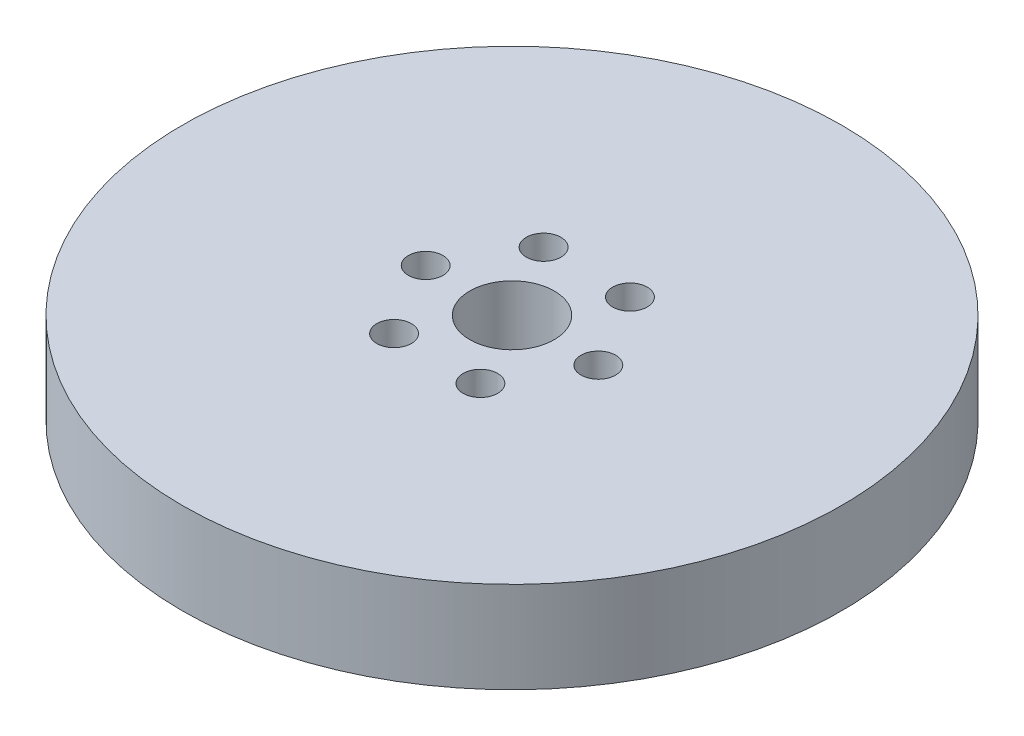
ISO-10303-21;
HEADER;
FILE_DESCRIPTION(('STEP AP214'),'2;1');
FILE_NAME('part.step','',(''),(''),'','','');
FILE_SCHEMA(('AUTOMOTIVE_DESIGN { 1 0 10303 214 1 1 1 1 }'));
ENDSEC;
DATA;
#1=APPLICATION_CONTEXT('core data for automotive mechanical design processes');
#2=APPLICATION_PROTOCOL_DEFINITION('international standard','automotive_design',2000,#1);
#3=PRODUCT_CONTEXT('',#1,'mechanical');
#4=PRODUCT('Part','Part','',(#3));
#5=PRODUCT_RELATED_PRODUCT_CATEGORY('part','',(#4));
#6=PRODUCT_DEFINITION_FORMATION('','',#4);
#7=PRODUCT_DEFINITION_CONTEXT('part definition',#1,'design');
#8=PRODUCT_DEFINITION('design','',#6,#7);
#9=PRODUCT_DEFINITION_SHAPE('','',#8);
#10=(LENGTH_UNIT() NAMED_UNIT(*) SI_UNIT(.MILLI.,.METRE.));
#11=(NAMED_UNIT(*) PLANE_ANGLE_UNIT() SI_UNIT($,.RADIAN.));
#12=(NAMED_UNIT(*) SI_UNIT($,.STERADIAN.) SOLID_ANGLE_UNIT());
#13=UNCERTAINTY_MEASURE_WITH_UNIT(LENGTH_MEASURE(1.E-05),#10,'distance_accuracy_value','');
#14=(GEOMETRIC_REPRESENTATION_CONTEXT(3) GLOBAL_UNCERTAINTY_ASSIGNED_CONTEXT((#13)) GLOBAL_UNIT_ASSIGNED_CONTEXT((#10,
#11,#12)) REPRESENTATION_CONTEXT('',''));
#15=CARTESIAN_POINT('',(0.,0.,0.));
#16=DIRECTION('',(0.,0.,1.));
#17=DIRECTION('',(1.,0.,0.));
#18=AXIS2_PLACEMENT_3D('',#15,#16,#17);
#19=CARTESIAN_POINT('',(0.,27.,0.));
#20=DIRECTION('',(0.,-1.,0.));
#21=DIRECTION('',(0.,0.,-1.));
#22=AXIS2_PLACEMENT_3D('',#19,#20,#21);
#23=CYLINDRICAL_SURFACE('',#22,97.5);
#24=CARTESIAN_POINT('',(0.,27.,0.));
#25=DIRECTION('',(0.,1.,0.));
#26=DIRECTION('',(0.,0.,1.));
#27=AXIS2_PLACEMENT_3D('',#24,#25,#26);
#28=CIRCLE('',#27,97.5);
#29=CARTESIAN_POINT('',(0.,27.,97.5));
#30=VERTEX_POINT('',#29);
#31=EDGE_CURVE('E10',#30,#30,#28,.T.);
#32=ORIENTED_EDGE('',*,*,#31,.F.);
#33=EDGE_LOOP('',(#32));
#34=FACE_BOUND('',#33,.T.);
#35=CARTESIAN_POINT('',(0.,0.,0.));
#36=DIRECTION('',(0.,1.,0.));
#37=DIRECTION('',(0.,0.,1.));
#38=AXIS2_PLACEMENT_3D('',#35,#36,#37);
#39=CIRCLE('',#38,97.5);
#40=CARTESIAN_POINT('',(0.,0.,97.5));
#41=VERTEX_POINT('',#40);
#42=EDGE_CURVE('E37',#41,#41,#39,.T.);
#43=ORIENTED_EDGE('',*,*,#42,.T.);
#44=EDGE_LOOP('',(#43));
#45=FACE_BOUND('',#44,.T.);
#46=ADVANCED_FACE('F40',(#34,#45),#23,.T.);
#47=CARTESIAN_POINT('',(0.,27.,0.));
#48=DIRECTION('',(0.,1.,0.));
#49=DIRECTION('',(0.,0.,1.));
#50=AXIS2_PLACEMENT_3D('',#47,#48,#49);
#51=PLANE('',#50);
#52=CARTESIAN_POINT('',(-12.7710832596308,27.,-22.1201650733723));
#53=DIRECTION('',(0.,1.,0.));
#54=DIRECTION('',(-0.866025403784433,0.,0.50000000000001));
#55=AXIS2_PLACEMENT_3D('',#52,#53,#54);
#56=CIRCLE('',#55,5.11753542298354);
#57=CARTESIAN_POINT('',(-17.2029989407013,27.,-19.5613973618805));
#58=VERTEX_POINT('',#57);
#59=EDGE_CURVE('E70',#58,#58,#56,.T.);
#60=ORIENTED_EDGE('',*,*,#59,.F.);
#61=EDGE_LOOP('',(#60));
#62=FACE_BOUND('',#61,.T.);
#63=CARTESIAN_POINT('',(12.7710832596303,27.,-22.1201650733726));
#64=DIRECTION('',(0.,1.,0.));
#65=DIRECTION('',(-0.866025403784443,0.,-0.499999999999992));
#66=AXIS2_PLACEMENT_3D('',#63,#64,#65);
#67=CIRCLE('',#66,5.11753542298354);
#68=CARTESIAN_POINT('',(8.33916757855982,27.,-24.6789327848643));
#69=VERTEX_POINT('',#68);
#70=EDGE_CURVE('E71',#69,#69,#67,.T.);
#71=ORIENTED_EDGE('',*,*,#70,.F.);
#72=EDGE_LOOP('',(#71));
#73=FACE_BOUND('',#72,.T.);
#74=CARTESIAN_POINT('',(25.5421665192611,27.,0.));
#75=DIRECTION('',(0.,1.,0.));
#76=DIRECTION('',(0.,0.,-1.));
#77=AXIS2_PLACEMENT_3D('',#74,#75,#76);
#78=CIRCLE('',#77,5.11753542298354);
#79=CARTESIAN_POINT('',(25.5421665192611,27.,-5.11753542298354));
#80=VERTEX_POINT('',#79);
#81=EDGE_CURVE('E78',#80,#80,#78,.T.);
#82=ORIENTED_EDGE('',*,*,#81,.F.);
#83=EDGE_LOOP('',(#82));
#84=FACE_BOUND('',#83,.T.);
#85=CARTESIAN_POINT('',(12.7710832596306,27.,22.1201650733724));
#86=DIRECTION('',(0.,1.,0.));
#87=DIRECTION('',(0.866025403784436,0.,-0.500000000000004));
#88=AXIS2_PLACEMENT_3D('',#85,#86,#87);
#89=CIRCLE('',#88,5.11753542298354);
#90=CARTESIAN_POINT('',(17.2029989407011,27.,19.5613973618806));
#91=VERTEX_POINT('',#90);
#92=EDGE_CURVE('E84',#91,#91,#89,.T.);
#93=ORIENTED_EDGE('',*,*,#92,.F.);
#94=EDGE_LOOP('',(#93));
#95=FACE_BOUND('',#94,.T.);
#96=CARTESIAN_POINT('',(-12.7710832596305,27.,22.1201650733725));
#97=DIRECTION('',(0.,1.,0.));
#98=DIRECTION('',(0.86602540378444,0.,0.499999999999998));
#99=AXIS2_PLACEMENT_3D('',#96,#97,#98);
#100=CIRCLE('',#99,5.11753542298354);
#101=CARTESIAN_POINT('',(-8.33916757855999,27.,24.6789327848642));
#102=VERTEX_POINT('',#101);
#103=EDGE_CURVE('E61',#102,#102,#100,.T.);
#104=ORIENTED_EDGE('',*,*,#103,.F.);
#105=EDGE_LOOP('',(#104));
#106=FACE_BOUND('',#105,.T.);
#107=CARTESIAN_POINT('',(-25.5421665192611,27.,0.));
#108=DIRECTION('',(0.,1.,0.));
#109=DIRECTION('',(0.,0.,1.));
#110=AXIS2_PLACEMENT_3D('',#107,#108,#109);
#111=CIRCLE('',#110,5.11753542298354);
#112=CARTESIAN_POINT('',(-25.5421665192611,27.,5.11753542298354));
#113=VERTEX_POINT('',#112);
#114=EDGE_CURVE('E54',#113,#113,#111,.T.);
#115=ORIENTED_EDGE('',*,*,#114,.F.);
#116=EDGE_LOOP('',(#115));
#117=FACE_BOUND('',#116,.T.);
#118=CARTESIAN_POINT('',(0.,27.,0.));
#119=DIRECTION('',(0.,1.,0.));
#120=DIRECTION('',(0.,0.,1.));
#121=AXIS2_PLACEMENT_3D('',#118,#119,#120);
#122=CIRCLE('',#121,12.5);
#123=CARTESIAN_POINT('',(0.,27.,12.5));
#124=VERTEX_POINT('',#123);
#125=EDGE_CURVE('E50',#124,#124,#122,.T.);
#126=ORIENTED_EDGE('',*,*,#125,.F.);
#127=EDGE_LOOP('',(#126));
#128=FACE_BOUND('',#127,.T.);
#129=ORIENTED_EDGE('',*,*,#31,.T.);
#130=EDGE_LOOP('',(#129));
#131=FACE_BOUND('',#130,.T.);
#132=ADVANCED_FACE('F99',(#62,#73,#84,#95,#106,#117,#128,#131),#51,.T.);
#133=CARTESIAN_POINT('',(0.,0.,0.));
#134=DIRECTION('',(0.,1.,0.));
#135=DIRECTION('',(0.,0.,1.));
#136=AXIS2_PLACEMENT_3D('',#133,#134,#135);
#137=PLANE('',#136);
#138=CARTESIAN_POINT('',(0.,0.,0.));
#139=DIRECTION('',(0.,1.,0.));
#140=DIRECTION('',(0.,0.,1.));
#141=AXIS2_PLACEMENT_3D('',#138,#139,#140);
#142=CIRCLE('',#141,12.5);
#143=CARTESIAN_POINT('',(0.,0.,12.5));
#144=VERTEX_POINT('',#143);
#145=EDGE_CURVE('E47',#144,#144,#142,.T.);
#146=ORIENTED_EDGE('',*,*,#145,.T.);
#147=EDGE_LOOP('',(#146));
#148=FACE_BOUND('',#147,.T.);
#149=ORIENTED_EDGE('',*,*,#42,.F.);
#150=EDGE_LOOP('',(#149));
#151=FACE_BOUND('',#150,.T.);
#152=ADVANCED_FACE('F103',(#148,#151),#137,.F.);
#153=CARTESIAN_POINT('',(0.,27.,0.));
#154=DIRECTION('',(0.,-1.,0.));
#155=DIRECTION('',(0.,0.,-1.));
#156=AXIS2_PLACEMENT_3D('',#153,#154,#155);
#157=CYLINDRICAL_SURFACE('',#156,12.5);
#158=ORIENTED_EDGE('',*,*,#125,.T.);
#159=EDGE_LOOP('',(#158));
#160=FACE_BOUND('',#159,.T.);
#161=ORIENTED_EDGE('',*,*,#145,.F.);
#162=EDGE_LOOP('',(#161));
#163=FACE_BOUND('',#162,.T.);
#164=ADVANCED_FACE('F115',(#160,#163),#157,.F.);
#165=CARTESIAN_POINT('',(-25.5421665192611,0.211922867244096,0.));
#166=DIRECTION('',(0.,1.,0.));
#167=DIRECTION('',(0.,0.,1.));
#168=AXIS2_PLACEMENT_3D('',#165,#166,#167);
#169=CYLINDRICAL_SURFACE('',#168,5.11753542298354);
#170=CARTESIAN_POINT('',(-25.5421665192611,0.211922867244096,0.));
#171=DIRECTION('',(0.,1.,0.));
#172=DIRECTION('',(0.,0.,1.));
#173=AXIS2_PLACEMENT_3D('',#170,#171,#172);
#174=CIRCLE('',#173,5.11753542298354);
#175=CARTESIAN_POINT('',(-25.5421665192611,0.211922867244096,5.11753542298354));
#176=VERTEX_POINT('',#175);
#177=EDGE_CURVE('E55',#176,#176,#174,.T.);
#178=ORIENTED_EDGE('',*,*,#177,.F.);
#179=EDGE_LOOP('',(#178));
#180=FACE_BOUND('',#179,.T.);
#181=ORIENTED_EDGE('',*,*,#114,.T.);
#182=EDGE_LOOP('',(#181));
#183=FACE_BOUND('',#182,.T.);
#184=ADVANCED_FACE('F113',(#180,#183),#169,.F.);
#185=CARTESIAN_POINT('',(-25.5421665192611,0.211922867244096,0.));
#186=DIRECTION('',(0.,1.,0.));
#187=DIRECTION('',(0.,0.,1.));
#188=AXIS2_PLACEMENT_3D('',#185,#186,#187);
#189=PLANE('',#188);
#190=ORIENTED_EDGE('',*,*,#177,.T.);
#191=EDGE_LOOP('',(#190));
#192=FACE_BOUND('',#191,.T.);
#193=ADVANCED_FACE('F144',(#192),#189,.T.);
#194=CARTESIAN_POINT('',(-12.7710832596305,0.211922867244096,22.1201650733725));
#195=DIRECTION('',(0.,1.,0.));
#196=DIRECTION('',(0.,0.,1.));
#197=AXIS2_PLACEMENT_3D('',#194,#195,#196);
#198=CYLINDRICAL_SURFACE('',#197,5.11753542298354);
#199=CARTESIAN_POINT('',(-12.7710832596305,0.211922867244096,22.1201650733725));
#200=DIRECTION('',(0.,1.,0.));
#201=DIRECTION('',(0.86602540378444,0.,0.499999999999998));
#202=AXIS2_PLACEMENT_3D('',#199,#200,#201);
#203=CIRCLE('',#202,5.11753542298354);
#204=CARTESIAN_POINT('',(-8.33916757855999,0.211922867244096,24.6789327848642));
#205=VERTEX_POINT('',#204);
#206=EDGE_CURVE('E59',#205,#205,#203,.T.);
#207=ORIENTED_EDGE('',*,*,#206,.F.);
#208=EDGE_LOOP('',(#207));
#209=FACE_BOUND('',#208,.T.);
#210=ORIENTED_EDGE('',*,*,#103,.T.);
#211=EDGE_LOOP('',(#210));
#212=FACE_BOUND('',#211,.T.);
#213=ADVANCED_FACE('F153',(#209,#212),#198,.F.);
#214=CARTESIAN_POINT('',(-12.7710832596305,0.211922867244096,22.1201650733725));
#215=DIRECTION('',(0.,1.,0.));
#216=DIRECTION('',(0.86602540378444,0.,0.499999999999998));
#217=AXIS2_PLACEMENT_3D('',#214,#215,#216);
#218=PLANE('',#217);
#219=ORIENTED_EDGE('',*,*,#206,.T.);
#220=EDGE_LOOP('',(#219));
#221=FACE_BOUND('',#220,.T.);
#222=ADVANCED_FACE('F96',(#221),#218,.T.);
#223=CARTESIAN_POINT('',(12.7710832596306,0.211922867244096,22.1201650733724));
#224=DIRECTION('',(0.,1.,0.));
#225=DIRECTION('',(0.,0.,1.));
#226=AXIS2_PLACEMENT_3D('',#223,#224,#225);
#227=CYLINDRICAL_SURFACE('',#226,5.11753542298354);
#228=CARTESIAN_POINT('',(12.7710832596306,0.211922867244096,22.1201650733724));
#229=DIRECTION('',(0.,1.,0.));
#230=DIRECTION('',(0.866025403784436,0.,-0.500000000000004));
#231=AXIS2_PLACEMENT_3D('',#228,#229,#230);
#232=CIRCLE('',#231,5.11753542298354);
#233=CARTESIAN_POINT('',(17.2029989407011,0.211922867244096,19.5613973618806));
#234=VERTEX_POINT('',#233);
#235=EDGE_CURVE('E63',#234,#234,#232,.T.);
#236=ORIENTED_EDGE('',*,*,#235,.F.);
#237=EDGE_LOOP('',(#236));
#238=FACE_BOUND('',#237,.T.);
#239=ORIENTED_EDGE('',*,*,#92,.T.);
#240=EDGE_LOOP('',(#239));
#241=FACE_BOUND('',#240,.T.);
#242=ADVANCED_FACE('F91',(#238,#241),#227,.F.);
#243=CARTESIAN_POINT('',(12.7710832596306,0.211922867244096,22.1201650733724));
#244=DIRECTION('',(0.,1.,0.));
#245=DIRECTION('',(0.866025403784436,0.,-0.500000000000004));
#246=AXIS2_PLACEMENT_3D('',#243,#244,#245);
#247=PLANE('',#246);
#248=ORIENTED_EDGE('',*,*,#235,.T.);
#249=EDGE_LOOP('',(#248));
#250=FACE_BOUND('',#249,.T.);
#251=ADVANCED_FACE('F93',(#250),#247,.T.);
#252=CARTESIAN_POINT('',(25.5421665192611,0.211922867244096,0.));
#253=DIRECTION('',(0.,1.,0.));
#254=DIRECTION('',(0.,0.,1.));
#255=AXIS2_PLACEMENT_3D('',#252,#253,#254);
#256=CYLINDRICAL_SURFACE('',#255,5.11753542298354);
#257=CARTESIAN_POINT('',(25.5421665192611,0.211922867244096,0.));
#258=DIRECTION('',(0.,1.,0.));
#259=DIRECTION('',(0.,0.,-1.));
#260=AXIS2_PLACEMENT_3D('',#257,#258,#259);
#261=CIRCLE('',#260,5.11753542298354);
#262=CARTESIAN_POINT('',(25.5421665192611,0.211922867244096,-5.11753542298354));
#263=VERTEX_POINT('',#262);
#264=EDGE_CURVE('E85',#263,#263,#261,.T.);
#265=ORIENTED_EDGE('',*,*,#264,.F.);
#266=EDGE_LOOP('',(#265));
#267=FACE_BOUND('',#266,.T.);
#268=ORIENTED_EDGE('',*,*,#81,.T.);
#269=EDGE_LOOP('',(#268));
#270=FACE_BOUND('',#269,.T.);
#271=ADVANCED_FACE('F187',(#267,#270),#256,.F.);
#272=CARTESIAN_POINT('',(25.5421665192611,0.211922867244096,0.));
#273=DIRECTION('',(0.,1.,0.));
#274=DIRECTION('',(0.,0.,-1.));
#275=AXIS2_PLACEMENT_3D('',#272,#273,#274);
#276=PLANE('',#275);
#277=ORIENTED_EDGE('',*,*,#264,.T.);
#278=EDGE_LOOP('',(#277));
#279=FACE_BOUND('',#278,.T.);
#280=ADVANCED_FACE('F198',(#279),#276,.T.);
#281=CARTESIAN_POINT('',(12.7710832596303,0.211922867244096,-22.1201650733726));
#282=DIRECTION('',(0.,1.,0.));
#283=DIRECTION('',(0.,0.,1.));
#284=AXIS2_PLACEMENT_3D('',#281,#282,#283);
#285=CYLINDRICAL_SURFACE('',#284,5.11753542298354);
#286=CARTESIAN_POINT('',(12.7710832596303,0.211922867244096,-22.1201650733726));
#287=DIRECTION('',(0.,1.,0.));
#288=DIRECTION('',(-0.866025403784443,0.,-0.499999999999992));
#289=AXIS2_PLACEMENT_3D('',#286,#287,#288);
#290=CIRCLE('',#289,5.11753542298354);
#291=CARTESIAN_POINT('',(8.33916757855982,0.211922867244096,-24.6789327848643));
#292=VERTEX_POINT('',#291);
#293=EDGE_CURVE('E76',#292,#292,#290,.T.);
#294=ORIENTED_EDGE('',*,*,#293,.F.);
#295=EDGE_LOOP('',(#294));
#296=FACE_BOUND('',#295,.T.);
#297=ORIENTED_EDGE('',*,*,#70,.T.);
#298=EDGE_LOOP('',(#297));
#299=FACE_BOUND('',#298,.T.);
#300=ADVANCED_FACE('F202',(#296,#299),#285,.F.);
#301=CARTESIAN_POINT('',(12.7710832596303,0.211922867244096,-22.1201650733726));
#302=DIRECTION('',(0.,1.,0.));
#303=DIRECTION('',(-0.866025403784443,0.,-0.499999999999992));
#304=AXIS2_PLACEMENT_3D('',#301,#302,#303);
#305=PLANE('',#304);
#306=ORIENTED_EDGE('',*,*,#293,.T.);
#307=EDGE_LOOP('',(#306));
#308=FACE_BOUND('',#307,.T.);
#309=ADVANCED_FACE('F212',(#308),#305,.T.);
#310=CARTESIAN_POINT('',(-12.7710832596308,0.211922867244096,-22.1201650733723));
#311=DIRECTION('',(0.,1.,0.));
#312=DIRECTION('',(0.,0.,1.));
#313=AXIS2_PLACEMENT_3D('',#310,#311,#312);
#314=CYLINDRICAL_SURFACE('',#313,5.11753542298354);
#315=CARTESIAN_POINT('',(-12.7710832596308,0.211922867244096,-22.1201650733723));
#316=DIRECTION('',(0.,1.,0.));
#317=DIRECTION('',(-0.866025403784433,0.,0.50000000000001));
#318=AXIS2_PLACEMENT_3D('',#315,#316,#317);
#319=CIRCLE('',#318,5.11753542298354);
#320=CARTESIAN_POINT('',(-17.2029989407013,0.211922867244096,-19.5613973618805));
#321=VERTEX_POINT('',#320);
#322=EDGE_CURVE('E69',#321,#321,#319,.T.);
#323=ORIENTED_EDGE('',*,*,#322,.F.);
#324=EDGE_LOOP('',(#323));
#325=FACE_BOUND('',#324,.T.);
#326=ORIENTED_EDGE('',*,*,#59,.T.);
#327=EDGE_LOOP('',(#326));
#328=FACE_BOUND('',#327,.T.);
#329=ADVANCED_FACE('F224',(#325,#328),#314,.F.);
#330=CARTESIAN_POINT('',(-12.7710832596308,0.211922867244096,-22.1201650733723));
#331=DIRECTION('',(0.,1.,0.));
#332=DIRECTION('',(-0.866025403784433,0.,0.50000000000001));
#333=AXIS2_PLACEMENT_3D('',#330,#331,#332);
#334=PLANE('',#333);
#335=ORIENTED_EDGE('',*,*,#322,.T.);
#336=EDGE_LOOP('',(#335));
#337=FACE_BOUND('',#336,.T.);
#338=ADVANCED_FACE('F235',(#337),#334,.T.);
#339=CLOSED_SHELL('',(#46,#132,#152,#164,#184,#193,#213,#222,#242,#251,#271,#280,#300,#309,#329,#338));
#340=MANIFOLD_SOLID_BREP('B2',#339);
#341=ADVANCED_BREP_SHAPE_REPRESENTATION('',(#18,#340),#14);
#342=SHAPE_DEFINITION_REPRESENTATION(#9,#341);
ENDSEC;
END-ISO-10303-21;
